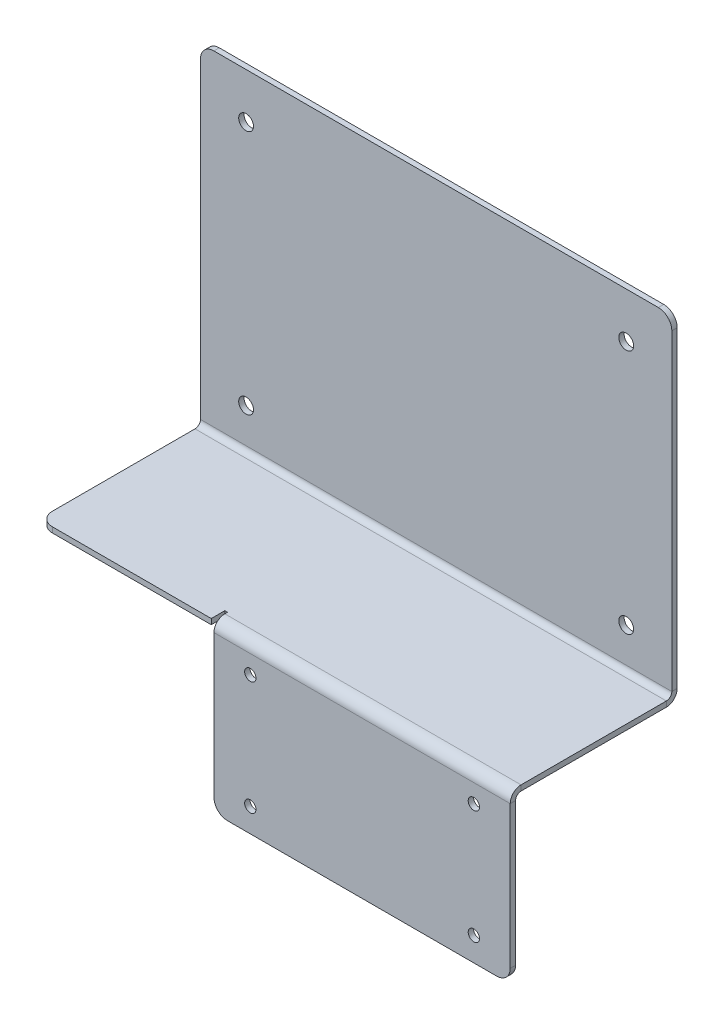
ISO-10303-21;
HEADER;
FILE_DESCRIPTION(('STEP AP214'),'2;1');
FILE_NAME('part.step','',(''),(''),'','','');
FILE_SCHEMA(('AUTOMOTIVE_DESIGN { 1 0 10303 214 1 1 1 1 }'));
ENDSEC;
DATA;
#1=APPLICATION_CONTEXT('core data for automotive mechanical design processes');
#2=APPLICATION_PROTOCOL_DEFINITION('international standard','automotive_design',2000,#1);
#3=PRODUCT_CONTEXT('',#1,'mechanical');
#4=PRODUCT('Part','Part','',(#3));
#5=PRODUCT_RELATED_PRODUCT_CATEGORY('part','',(#4));
#6=PRODUCT_DEFINITION_FORMATION('','',#4);
#7=PRODUCT_DEFINITION_CONTEXT('part definition',#1,'design');
#8=PRODUCT_DEFINITION('design','',#6,#7);
#9=PRODUCT_DEFINITION_SHAPE('','',#8);
#10=(LENGTH_UNIT() NAMED_UNIT(*) SI_UNIT(.MILLI.,.METRE.));
#11=(NAMED_UNIT(*) PLANE_ANGLE_UNIT() SI_UNIT($,.RADIAN.));
#12=(NAMED_UNIT(*) SI_UNIT($,.STERADIAN.) SOLID_ANGLE_UNIT());
#13=UNCERTAINTY_MEASURE_WITH_UNIT(LENGTH_MEASURE(1.E-05),#10,'distance_accuracy_value','');
#14=(GEOMETRIC_REPRESENTATION_CONTEXT(3) GLOBAL_UNCERTAINTY_ASSIGNED_CONTEXT((#13)) GLOBAL_UNIT_ASSIGNED_CONTEXT((#10,
#11,#12)) REPRESENTATION_CONTEXT('',''));
#15=CARTESIAN_POINT('',(0.,0.,0.));
#16=DIRECTION('',(0.,0.,1.));
#17=DIRECTION('',(1.,0.,0.));
#18=AXIS2_PLACEMENT_3D('',#15,#16,#17);
#19=CARTESIAN_POINT('',(0.,-62.500000000001,-2.23823397174791E-13));
#20=DIRECTION('',(0.,-1.,0.));
#21=DIRECTION('',(0.,0.,-1.));
#22=AXIS2_PLACEMENT_3D('',#19,#20,#21);
#23=PLANE('',#22);
#24=DIRECTION('',(1.,0.,0.));
#25=VECTOR('',#24,1.);
#26=CARTESIAN_POINT('',(87.5000000000004,-62.5000000000012,62.));
#27=LINE('',#26,#25);
#28=CARTESIAN_POINT('',(-82.4999999999997,-62.5000000000012,62.));
#29=VERTEX_POINT('',#28);
#30=CARTESIAN_POINT('',(-23.4999999999997,-62.5000000000012,62.));
#31=VERTEX_POINT('',#30);
#32=EDGE_CURVE('E311',#29,#31,#27,.T.);
#33=ORIENTED_EDGE('',*,*,#32,.F.);
#34=CARTESIAN_POINT('',(-82.4999999999997,-62.5000000000012,57.));
#35=DIRECTION('',(0.,-1.,0.));
#36=DIRECTION('',(0.,0.,-1.));
#37=AXIS2_PLACEMENT_3D('',#34,#35,#36);
#38=CIRCLE('',#37,5.);
#39=CARTESIAN_POINT('',(-87.4999999999997,-62.5000000000012,57.));
#40=VERTEX_POINT('',#39);
#41=EDGE_CURVE('E422',#29,#40,#38,.T.);
#42=ORIENTED_EDGE('',*,*,#41,.T.);
#43=DIRECTION('',(0.,0.,1.));
#44=VECTOR('',#43,1.);
#45=CARTESIAN_POINT('',(-87.4999999999997,-62.5000000000012,62.));
#46=LINE('',#45,#44);
#47=CARTESIAN_POINT('',(-87.4999999999997,-62.500000000001,4.02999999999999));
#48=VERTEX_POINT('',#47);
#49=EDGE_CURVE('E313',#48,#40,#46,.T.);
#50=ORIENTED_EDGE('',*,*,#49,.F.);
#51=DIRECTION('',(1.,0.,0.));
#52=VECTOR('',#51,1.);
#53=CARTESIAN_POINT('',(0.,-62.500000000001,4.02999999999999));
#54=LINE('',#53,#52);
#55=CARTESIAN_POINT('',(87.5000000000004,-62.500000000001,4.02999999999999));
#56=VERTEX_POINT('',#55);
#57=EDGE_CURVE('E323',#48,#56,#54,.T.);
#58=ORIENTED_EDGE('',*,*,#57,.T.);
#59=DIRECTION('',(0.,0.,-1.));
#60=VECTOR('',#59,1.);
#61=CARTESIAN_POINT('',(87.5000000000004,-62.500000000001,1.99999999999999));
#62=LINE('',#61,#60);
#63=CARTESIAN_POINT('',(87.5000000000004,-62.5000000000012,57.97));
#64=VERTEX_POINT('',#63);
#65=EDGE_CURVE('E308',#64,#56,#62,.T.);
#66=ORIENTED_EDGE('',*,*,#65,.F.);
#67=DIRECTION('',(-1.,0.,0.));
#68=VECTOR('',#67,1.);
#69=CARTESIAN_POINT('',(-22.4999999999997,-62.5000000000012,57.97));
#70=LINE('',#69,#68);
#71=CARTESIAN_POINT('',(-22.4999999999997,-62.5000000000012,57.97));
#72=VERTEX_POINT('',#71);
#73=EDGE_CURVE('E278',#72,#64,#70,.F.);
#74=ORIENTED_EDGE('',*,*,#73,.F.);
#75=DIRECTION('',(0.,0.,1.));
#76=VECTOR('',#75,1.);
#77=CARTESIAN_POINT('',(-22.4999999999997,-62.5000000000012,56.97));
#78=LINE('',#77,#76);
#79=CARTESIAN_POINT('',(-22.4999999999997,-62.5000000000012,56.97));
#80=VERTEX_POINT('',#79);
#81=EDGE_CURVE('E297',#80,#72,#78,.T.);
#82=ORIENTED_EDGE('',*,*,#81,.F.);
#83=DIRECTION('',(1.,0.,0.));
#84=VECTOR('',#83,1.);
#85=CARTESIAN_POINT('',(-23.4999999999997,-62.5000000000012,56.97));
#86=LINE('',#85,#84);
#87=CARTESIAN_POINT('',(-23.4999999999997,-62.5000000000012,56.97));
#88=VERTEX_POINT('',#87);
#89=EDGE_CURVE('E293',#88,#80,#86,.T.);
#90=ORIENTED_EDGE('',*,*,#89,.F.);
#91=DIRECTION('',(0.,0.,-1.));
#92=VECTOR('',#91,1.);
#93=CARTESIAN_POINT('',(-23.4999999999997,-62.5000000000012,62.));
#94=LINE('',#93,#92);
#95=EDGE_CURVE('E288',#31,#88,#94,.T.);
#96=ORIENTED_EDGE('',*,*,#95,.F.);
#97=EDGE_LOOP('',(#33,#42,#50,#58,#66,#74,#82,#90,#96));
#98=FACE_BOUND('',#97,.T.);
#99=ADVANCED_FACE('F76',(#98),#23,.T.);
#100=CARTESIAN_POINT('',(0.,-60.500000000001,-2.16840434497104E-13));
#101=DIRECTION('',(0.,-1.,0.));
#102=DIRECTION('',(0.,0.,-1.));
#103=AXIS2_PLACEMENT_3D('',#100,#101,#102);
#104=PLANE('',#103);
#105=DIRECTION('',(0.,0.,-1.));
#106=VECTOR('',#105,1.);
#107=CARTESIAN_POINT('',(-87.4999999999997,-60.500000000001,-2.16840434497104E-13));
#108=LINE('',#107,#106);
#109=CARTESIAN_POINT('',(-87.4999999999997,-60.500000000001,4.03));
#110=VERTEX_POINT('',#109);
#111=CARTESIAN_POINT('',(-87.4999999999997,-60.5000000000012,57.));
#112=VERTEX_POINT('',#111);
#113=EDGE_CURVE('E320',#110,#112,#108,.F.);
#114=ORIENTED_EDGE('',*,*,#113,.T.);
#115=CARTESIAN_POINT('',(-82.4999999999997,-60.5000000000012,57.));
#116=DIRECTION('',(0.,-1.,0.));
#117=DIRECTION('',(0.,0.,-1.));
#118=AXIS2_PLACEMENT_3D('',#115,#116,#117);
#119=CIRCLE('',#118,5.);
#120=CARTESIAN_POINT('',(-82.4999999999997,-60.5000000000012,62.));
#121=VERTEX_POINT('',#120);
#122=EDGE_CURVE('E418',#112,#121,#119,.F.);
#123=ORIENTED_EDGE('',*,*,#122,.T.);
#124=DIRECTION('',(-1.,0.,0.));
#125=VECTOR('',#124,1.);
#126=CARTESIAN_POINT('',(0.,-60.5000000000012,62.));
#127=LINE('',#126,#125);
#128=CARTESIAN_POINT('',(-23.4999999999997,-60.5000000000012,62.));
#129=VERTEX_POINT('',#128);
#130=EDGE_CURVE('E318',#121,#129,#127,.F.);
#131=ORIENTED_EDGE('',*,*,#130,.T.);
#132=DIRECTION('',(0.,0.,1.));
#133=VECTOR('',#132,1.);
#134=CARTESIAN_POINT('',(-23.4999999999997,-60.500000000001,-2.16840434497104E-13));
#135=LINE('',#134,#133);
#136=CARTESIAN_POINT('',(-23.4999999999997,-60.5000000000012,56.97));
#137=VERTEX_POINT('',#136);
#138=EDGE_CURVE('E291',#137,#129,#135,.T.);
#139=ORIENTED_EDGE('',*,*,#138,.F.);
#140=DIRECTION('',(-1.,0.,0.));
#141=VECTOR('',#140,1.);
#142=CARTESIAN_POINT('',(0.,-60.5000000000012,56.97));
#143=LINE('',#142,#141);
#144=CARTESIAN_POINT('',(-22.4999999999997,-60.5000000000012,56.97));
#145=VERTEX_POINT('',#144);
#146=EDGE_CURVE('E396',#145,#137,#143,.T.);
#147=ORIENTED_EDGE('',*,*,#146,.F.);
#148=DIRECTION('',(0.,0.,-1.));
#149=VECTOR('',#148,1.);
#150=CARTESIAN_POINT('',(-22.4999999999997,-60.500000000001,-2.16840434497104E-13));
#151=LINE('',#150,#149);
#152=CARTESIAN_POINT('',(-22.4999999999997,-60.5000000000012,57.97));
#153=VERTEX_POINT('',#152);
#154=EDGE_CURVE('E389',#153,#145,#151,.T.);
#155=ORIENTED_EDGE('',*,*,#154,.F.);
#156=DIRECTION('',(-1.,0.,0.));
#157=VECTOR('',#156,1.);
#158=CARTESIAN_POINT('',(-22.4999999999997,-60.5000000000012,57.97));
#159=LINE('',#158,#157);
#160=CARTESIAN_POINT('',(87.5000000000004,-60.5000000000012,57.97));
#161=VERTEX_POINT('',#160);
#162=EDGE_CURVE('E244',#153,#161,#159,.F.);
#163=ORIENTED_EDGE('',*,*,#162,.T.);
#164=DIRECTION('',(0.,0.,1.));
#165=VECTOR('',#164,1.);
#166=CARTESIAN_POINT('',(87.5000000000004,-60.500000000001,-2.16840434497104E-13));
#167=LINE('',#166,#165);
#168=CARTESIAN_POINT('',(87.5000000000004,-60.500000000001,4.03));
#169=VERTEX_POINT('',#168);
#170=EDGE_CURVE('E316',#161,#169,#167,.F.);
#171=ORIENTED_EDGE('',*,*,#170,.T.);
#172=DIRECTION('',(-1.,0.,0.));
#173=VECTOR('',#172,1.);
#174=CARTESIAN_POINT('',(-87.4999999999997,-60.500000000001,4.03));
#175=LINE('',#174,#173);
#176=EDGE_CURVE('E329',#110,#169,#175,.F.);
#177=ORIENTED_EDGE('',*,*,#176,.F.);
#178=EDGE_LOOP('',(#114,#123,#131,#139,#147,#155,#163,#171,#177));
#179=FACE_BOUND('',#178,.T.);
#180=ADVANCED_FACE('F460',(#179),#104,.F.);
#181=CARTESIAN_POINT('',(87.5000000000004,-62.5000000000012,62.));
#182=DIRECTION('',(0.,0.,1.));
#183=DIRECTION('',(0.,-1.,0.));
#184=AXIS2_PLACEMENT_3D('',#181,#182,#183);
#185=PLANE('',#184);
#186=ORIENTED_EDGE('',*,*,#130,.F.);
#187=DIRECTION('',(0.,1.,0.));
#188=VECTOR('',#187,1.);
#189=CARTESIAN_POINT('',(-82.4999999999997,-62.5000000000012,62.));
#190=LINE('',#189,#188);
#191=EDGE_CURVE('E420',#121,#29,#190,.F.);
#192=ORIENTED_EDGE('',*,*,#191,.T.);
#193=ORIENTED_EDGE('',*,*,#32,.T.);
#194=DIRECTION('',(0.,1.,0.));
#195=VECTOR('',#194,1.);
#196=CARTESIAN_POINT('',(-23.4999999999997,-62.5000000000012,62.));
#197=LINE('',#196,#195);
#198=EDGE_CURVE('E292',#31,#129,#197,.T.);
#199=ORIENTED_EDGE('',*,*,#198,.T.);
#200=EDGE_LOOP('',(#186,#192,#193,#199));
#201=FACE_BOUND('',#200,.T.);
#202=ADVANCED_FACE('F473',(#201),#185,.T.);
#203=CARTESIAN_POINT('',(0.,0.,2.));
#204=DIRECTION('',(0.,0.,-1.));
#205=DIRECTION('',(-1.,0.,0.));
#206=AXIS2_PLACEMENT_3D('',#203,#204,#205);
#207=PLANE('',#206);
#208=CARTESIAN_POINT('',(-70.5633999999997,-45.5633999999989,2.));
#209=DIRECTION('',(0.,0.,1.));
#210=DIRECTION('',(1.,0.,0.));
#211=AXIS2_PLACEMENT_3D('',#208,#209,#210);
#212=CIRCLE('',#211,2.75000000000002);
#213=CARTESIAN_POINT('',(-67.8133999999997,-45.5633999999989,2.));
#214=VERTEX_POINT('',#213);
#215=EDGE_CURVE('E358',#214,#214,#212,.T.);
#216=ORIENTED_EDGE('',*,*,#215,.F.);
#217=EDGE_LOOP('',(#216));
#218=FACE_BOUND('',#217,.T.);
#219=CARTESIAN_POINT('',(-70.5633999999988,45.5634000000009,2.));
#220=DIRECTION('',(0.,0.,1.));
#221=DIRECTION('',(1.,0.,0.));
#222=AXIS2_PLACEMENT_3D('',#219,#220,#221);
#223=CIRCLE('',#222,2.75000000000002);
#224=CARTESIAN_POINT('',(-67.8133999999988,45.5634000000009,2.));
#225=VERTEX_POINT('',#224);
#226=EDGE_CURVE('E364',#225,#225,#223,.T.);
#227=ORIENTED_EDGE('',*,*,#226,.F.);
#228=EDGE_LOOP('',(#227));
#229=FACE_BOUND('',#228,.T.);
#230=CARTESIAN_POINT('',(70.5634000000006,-45.5634000000003,2.));
#231=DIRECTION('',(0.,0.,1.));
#232=DIRECTION('',(1.,0.,0.));
#233=AXIS2_PLACEMENT_3D('',#230,#231,#232);
#234=CIRCLE('',#233,2.75000000000002);
#235=CARTESIAN_POINT('',(73.3134000000006,-45.5634000000003,2.));
#236=VERTEX_POINT('',#235);
#237=EDGE_CURVE('E370',#236,#236,#234,.T.);
#238=ORIENTED_EDGE('',*,*,#237,.F.);
#239=EDGE_LOOP('',(#238));
#240=FACE_BOUND('',#239,.T.);
#241=CARTESIAN_POINT('',(70.5634000000013,45.5633999999998,2.));
#242=DIRECTION('',(0.,0.,1.));
#243=DIRECTION('',(1.,0.,0.));
#244=AXIS2_PLACEMENT_3D('',#241,#242,#243);
#245=CIRCLE('',#244,2.75000000000002);
#246=CARTESIAN_POINT('',(73.3134000000013,45.5633999999998,2.));
#247=VERTEX_POINT('',#246);
#248=EDGE_CURVE('E376',#247,#247,#245,.T.);
#249=ORIENTED_EDGE('',*,*,#248,.F.);
#250=EDGE_LOOP('',(#249));
#251=FACE_BOUND('',#250,.T.);
#252=DIRECTION('',(0.,1.,0.));
#253=VECTOR('',#252,1.);
#254=CARTESIAN_POINT('',(87.5000000000004,62.5,2.));
#255=LINE('',#254,#253);
#256=CARTESIAN_POINT('',(87.5000000000004,-58.470000000001,2.00000000000001));
#257=VERTEX_POINT('',#256);
#258=CARTESIAN_POINT('',(87.5000000000004,57.5,2.));
#259=VERTEX_POINT('',#258);
#260=EDGE_CURVE('E387',#257,#259,#255,.T.);
#261=ORIENTED_EDGE('',*,*,#260,.T.);
#262=CARTESIAN_POINT('',(82.5000000000004,57.5,2.));
#263=DIRECTION('',(0.,0.,-1.));
#264=DIRECTION('',(-1.,0.,0.));
#265=AXIS2_PLACEMENT_3D('',#262,#263,#264);
#266=CIRCLE('',#265,5.);
#267=CARTESIAN_POINT('',(82.5000000000004,62.5,2.));
#268=VERTEX_POINT('',#267);
#269=EDGE_CURVE('E84',#259,#268,#266,.F.);
#270=ORIENTED_EDGE('',*,*,#269,.T.);
#271=DIRECTION('',(-1.,0.,0.));
#272=VECTOR('',#271,1.);
#273=CARTESIAN_POINT('',(-87.4999999999997,62.5,2.));
#274=LINE('',#273,#272);
#275=CARTESIAN_POINT('',(-82.4999999999997,62.5,2.));
#276=VERTEX_POINT('',#275);
#277=EDGE_CURVE('E382',#268,#276,#274,.T.);
#278=ORIENTED_EDGE('',*,*,#277,.T.);
#279=CARTESIAN_POINT('',(-82.4999999999997,57.5,2.));
#280=DIRECTION('',(0.,0.,-1.));
#281=DIRECTION('',(-1.,0.,0.));
#282=AXIS2_PLACEMENT_3D('',#279,#280,#281);
#283=CIRCLE('',#282,5.);
#284=CARTESIAN_POINT('',(-87.4999999999997,57.5,2.));
#285=VERTEX_POINT('',#284);
#286=EDGE_CURVE('E91',#276,#285,#283,.F.);
#287=ORIENTED_EDGE('',*,*,#286,.T.);
#288=DIRECTION('',(0.,-1.,0.));
#289=VECTOR('',#288,1.);
#290=CARTESIAN_POINT('',(-87.4999999999997,62.5,2.));
#291=LINE('',#290,#289);
#292=CARTESIAN_POINT('',(-87.4999999999997,-58.470000000001,2.00000000000001));
#293=VERTEX_POINT('',#292);
#294=EDGE_CURVE('E384',#285,#293,#291,.T.);
#295=ORIENTED_EDGE('',*,*,#294,.T.);
#296=DIRECTION('',(1.,0.,0.));
#297=VECTOR('',#296,1.);
#298=CARTESIAN_POINT('',(87.5000000000004,-58.470000000001,2.00000000000001));
#299=LINE('',#298,#297);
#300=EDGE_CURVE('E347',#257,#293,#299,.F.);
#301=ORIENTED_EDGE('',*,*,#300,.F.);
#302=EDGE_LOOP('',(#261,#270,#278,#287,#295,#301));
#303=FACE_BOUND('',#302,.T.);
#304=ADVANCED_FACE('F436',(#218,#229,#240,#251,#303),#207,.F.);
#305=CARTESIAN_POINT('',(0.,0.,0.));
#306=DIRECTION('',(0.,0.,-1.));
#307=DIRECTION('',(-1.,0.,0.));
#308=AXIS2_PLACEMENT_3D('',#305,#306,#307);
#309=PLANE('',#308);
#310=CARTESIAN_POINT('',(-70.5633999999988,45.5634000000009,0.));
#311=DIRECTION('',(0.,0.,1.));
#312=DIRECTION('',(1.,0.,0.));
#313=AXIS2_PLACEMENT_3D('',#310,#311,#312);
#314=CIRCLE('',#313,2.75000000000002);
#315=CARTESIAN_POINT('',(-67.8133999999988,45.5634000000009,0.));
#316=VERTEX_POINT('',#315);
#317=EDGE_CURVE('E361',#316,#316,#314,.T.);
#318=ORIENTED_EDGE('',*,*,#317,.T.);
#319=EDGE_LOOP('',(#318));
#320=FACE_BOUND('',#319,.T.);
#321=CARTESIAN_POINT('',(70.5634000000013,45.5633999999998,0.));
#322=DIRECTION('',(0.,0.,1.));
#323=DIRECTION('',(1.,0.,0.));
#324=AXIS2_PLACEMENT_3D('',#321,#322,#323);
#325=CIRCLE('',#324,2.75000000000002);
#326=CARTESIAN_POINT('',(73.3134000000013,45.5633999999998,0.));
#327=VERTEX_POINT('',#326);
#328=EDGE_CURVE('E373',#327,#327,#325,.T.);
#329=ORIENTED_EDGE('',*,*,#328,.T.);
#330=EDGE_LOOP('',(#329));
#331=FACE_BOUND('',#330,.T.);
#332=CARTESIAN_POINT('',(70.5634000000006,-45.5634000000003,0.));
#333=DIRECTION('',(0.,0.,1.));
#334=DIRECTION('',(1.,0.,0.));
#335=AXIS2_PLACEMENT_3D('',#332,#333,#334);
#336=CIRCLE('',#335,2.75000000000002);
#337=CARTESIAN_POINT('',(73.3134000000006,-45.5634000000003,0.));
#338=VERTEX_POINT('',#337);
#339=EDGE_CURVE('E367',#338,#338,#336,.T.);
#340=ORIENTED_EDGE('',*,*,#339,.T.);
#341=EDGE_LOOP('',(#340));
#342=FACE_BOUND('',#341,.T.);
#343=CARTESIAN_POINT('',(-70.5633999999997,-45.5633999999989,0.));
#344=DIRECTION('',(0.,0.,1.));
#345=DIRECTION('',(1.,0.,0.));
#346=AXIS2_PLACEMENT_3D('',#343,#344,#345);
#347=CIRCLE('',#346,2.75000000000002);
#348=CARTESIAN_POINT('',(-67.8133999999997,-45.5633999999989,0.));
#349=VERTEX_POINT('',#348);
#350=EDGE_CURVE('E355',#349,#349,#347,.T.);
#351=ORIENTED_EDGE('',*,*,#350,.T.);
#352=EDGE_LOOP('',(#351));
#353=FACE_BOUND('',#352,.T.);
#354=DIRECTION('',(-1.,0.,0.));
#355=VECTOR('',#354,1.);
#356=CARTESIAN_POINT('',(-87.4999999999997,62.5,0.));
#357=LINE('',#356,#355);
#358=CARTESIAN_POINT('',(82.5000000000004,62.5,0.));
#359=VERTEX_POINT('',#358);
#360=CARTESIAN_POINT('',(-82.4999999999997,62.5,0.));
#361=VERTEX_POINT('',#360);
#362=EDGE_CURVE('E379',#359,#361,#357,.T.);
#363=ORIENTED_EDGE('',*,*,#362,.F.);
#364=CARTESIAN_POINT('',(82.5000000000004,57.5,0.));
#365=DIRECTION('',(0.,0.,-1.));
#366=DIRECTION('',(-1.,0.,0.));
#367=AXIS2_PLACEMENT_3D('',#364,#365,#366);
#368=CIRCLE('',#367,5.);
#369=CARTESIAN_POINT('',(87.5000000000004,57.5,0.));
#370=VERTEX_POINT('',#369);
#371=EDGE_CURVE('E431',#359,#370,#368,.T.);
#372=ORIENTED_EDGE('',*,*,#371,.T.);
#373=DIRECTION('',(0.,1.,0.));
#374=VECTOR('',#373,1.);
#375=CARTESIAN_POINT('',(87.5000000000004,62.5,0.));
#376=LINE('',#375,#374);
#377=CARTESIAN_POINT('',(87.5000000000004,-58.470000000001,0.));
#378=VERTEX_POINT('',#377);
#379=EDGE_CURVE('E385',#378,#370,#376,.T.);
#380=ORIENTED_EDGE('',*,*,#379,.F.);
#381=DIRECTION('',(1.,0.,0.));
#382=VECTOR('',#381,1.);
#383=CARTESIAN_POINT('',(87.5000000000004,-58.470000000001,0.));
#384=LINE('',#383,#382);
#385=CARTESIAN_POINT('',(-87.4999999999997,-58.470000000001,0.));
#386=VERTEX_POINT('',#385);
#387=EDGE_CURVE('E334',#378,#386,#384,.F.);
#388=ORIENTED_EDGE('',*,*,#387,.T.);
#389=DIRECTION('',(0.,-1.,0.));
#390=VECTOR('',#389,1.);
#391=CARTESIAN_POINT('',(-87.4999999999997,62.5,0.));
#392=LINE('',#391,#390);
#393=CARTESIAN_POINT('',(-87.4999999999997,57.5,0.));
#394=VERTEX_POINT('',#393);
#395=EDGE_CURVE('E392',#394,#386,#392,.T.);
#396=ORIENTED_EDGE('',*,*,#395,.F.);
#397=CARTESIAN_POINT('',(-82.4999999999997,57.5,0.));
#398=DIRECTION('',(0.,0.,-1.));
#399=DIRECTION('',(-1.,0.,0.));
#400=AXIS2_PLACEMENT_3D('',#397,#398,#399);
#401=CIRCLE('',#400,5.);
#402=EDGE_CURVE('E429',#394,#361,#401,.T.);
#403=ORIENTED_EDGE('',*,*,#402,.T.);
#404=EDGE_LOOP('',(#363,#372,#380,#388,#396,#403));
#405=FACE_BOUND('',#404,.T.);
#406=ADVANCED_FACE('F447',(#320,#331,#342,#353,#405),#309,.T.);
#407=CARTESIAN_POINT('',(-87.4999999999997,62.5,2.));
#408=DIRECTION('',(1.,0.,0.));
#409=DIRECTION('',(0.,0.,-1.));
#410=AXIS2_PLACEMENT_3D('',#407,#408,#409);
#411=PLANE('',#410);
#412=ORIENTED_EDGE('',*,*,#294,.F.);
#413=DIRECTION('',(0.,0.,-1.));
#414=VECTOR('',#413,1.);
#415=CARTESIAN_POINT('',(-87.4999999999997,57.5,2.));
#416=LINE('',#415,#414);
#417=EDGE_CURVE('E13',#285,#394,#416,.T.);
#418=ORIENTED_EDGE('',*,*,#417,.T.);
#419=ORIENTED_EDGE('',*,*,#395,.T.);
#420=DIRECTION('',(0.,0.,-1.));
#421=VECTOR('',#420,1.);
#422=CARTESIAN_POINT('',(-87.4999999999997,-58.470000000001,2.00000000000001));
#423=LINE('',#422,#421);
#424=EDGE_CURVE('E352',#293,#386,#423,.T.);
#425=ORIENTED_EDGE('',*,*,#424,.F.);
#426=EDGE_LOOP('',(#412,#418,#419,#425));
#427=FACE_BOUND('',#426,.T.);
#428=ADVANCED_FACE('F612',(#427),#411,.F.);
#429=CARTESIAN_POINT('',(87.5000000000004,62.5,2.));
#430=DIRECTION('',(-1.,0.,0.));
#431=DIRECTION('',(0.,0.,1.));
#432=AXIS2_PLACEMENT_3D('',#429,#430,#431);
#433=PLANE('',#432);
#434=ORIENTED_EDGE('',*,*,#379,.T.);
#435=DIRECTION('',(0.,0.,-1.));
#436=VECTOR('',#435,1.);
#437=CARTESIAN_POINT('',(87.5000000000004,57.5,2.));
#438=LINE('',#437,#436);
#439=EDGE_CURVE('E99',#370,#259,#438,.F.);
#440=ORIENTED_EDGE('',*,*,#439,.T.);
#441=ORIENTED_EDGE('',*,*,#260,.F.);
#442=DIRECTION('',(0.,0.,-1.));
#443=VECTOR('',#442,1.);
#444=CARTESIAN_POINT('',(87.5000000000004,-58.470000000001,2.00000000000001));
#445=LINE('',#444,#443);
#446=EDGE_CURVE('E341',#257,#378,#445,.T.);
#447=ORIENTED_EDGE('',*,*,#446,.T.);
#448=EDGE_LOOP('',(#434,#440,#441,#447));
#449=FACE_BOUND('',#448,.T.);
#450=ADVANCED_FACE('F448',(#449),#433,.F.);
#451=CARTESIAN_POINT('',(-87.4999999999997,62.5,2.));
#452=DIRECTION('',(0.,-1.,0.));
#453=DIRECTION('',(0.,0.,-1.));
#454=AXIS2_PLACEMENT_3D('',#451,#452,#453);
#455=PLANE('',#454);
#456=ORIENTED_EDGE('',*,*,#277,.F.);
#457=DIRECTION('',(0.,0.,-1.));
#458=VECTOR('',#457,1.);
#459=CARTESIAN_POINT('',(82.5000000000004,62.5,2.));
#460=LINE('',#459,#458);
#461=EDGE_CURVE('E426',#268,#359,#460,.T.);
#462=ORIENTED_EDGE('',*,*,#461,.T.);
#463=ORIENTED_EDGE('',*,*,#362,.T.);
#464=DIRECTION('',(0.,0.,-1.));
#465=VECTOR('',#464,1.);
#466=CARTESIAN_POINT('',(-82.4999999999997,62.5,2.));
#467=LINE('',#466,#465);
#468=EDGE_CURVE('E424',#361,#276,#467,.F.);
#469=ORIENTED_EDGE('',*,*,#468,.T.);
#470=EDGE_LOOP('',(#456,#462,#463,#469));
#471=FACE_BOUND('',#470,.T.);
#472=ADVANCED_FACE('F441',(#471),#455,.F.);
#473=CARTESIAN_POINT('',(70.5634000000013,45.5633999999998,2.));
#474=DIRECTION('',(0.,0.,-1.));
#475=DIRECTION('',(-1.,0.,0.));
#476=AXIS2_PLACEMENT_3D('',#473,#474,#475);
#477=CYLINDRICAL_SURFACE('',#476,2.75000000000002);
#478=ORIENTED_EDGE('',*,*,#248,.T.);
#479=EDGE_LOOP('',(#478));
#480=FACE_BOUND('',#479,.T.);
#481=ORIENTED_EDGE('',*,*,#328,.F.);
#482=EDGE_LOOP('',(#481));
#483=FACE_BOUND('',#482,.T.);
#484=ADVANCED_FACE('F602',(#480,#483),#477,.F.);
#485=CARTESIAN_POINT('',(70.5634000000006,-45.5634000000003,2.));
#486=DIRECTION('',(0.,0.,-1.));
#487=DIRECTION('',(-1.,0.,0.));
#488=AXIS2_PLACEMENT_3D('',#485,#486,#487);
#489=CYLINDRICAL_SURFACE('',#488,2.75000000000002);
#490=ORIENTED_EDGE('',*,*,#237,.T.);
#491=EDGE_LOOP('',(#490));
#492=FACE_BOUND('',#491,.T.);
#493=ORIENTED_EDGE('',*,*,#339,.F.);
#494=EDGE_LOOP('',(#493));
#495=FACE_BOUND('',#494,.T.);
#496=ADVANCED_FACE('F598',(#492,#495),#489,.F.);
#497=CARTESIAN_POINT('',(-70.5633999999988,45.5634000000009,2.));
#498=DIRECTION('',(0.,0.,-1.));
#499=DIRECTION('',(-1.,0.,0.));
#500=AXIS2_PLACEMENT_3D('',#497,#498,#499);
#501=CYLINDRICAL_SURFACE('',#500,2.75000000000002);
#502=ORIENTED_EDGE('',*,*,#226,.T.);
#503=EDGE_LOOP('',(#502));
#504=FACE_BOUND('',#503,.T.);
#505=ORIENTED_EDGE('',*,*,#317,.F.);
#506=EDGE_LOOP('',(#505));
#507=FACE_BOUND('',#506,.T.);
#508=ADVANCED_FACE('F594',(#504,#507),#501,.F.);
#509=CARTESIAN_POINT('',(-70.5633999999997,-45.5633999999989,2.));
#510=DIRECTION('',(0.,0.,-1.));
#511=DIRECTION('',(-1.,0.,0.));
#512=AXIS2_PLACEMENT_3D('',#509,#510,#511);
#513=CYLINDRICAL_SURFACE('',#512,2.75000000000002);
#514=ORIENTED_EDGE('',*,*,#215,.T.);
#515=EDGE_LOOP('',(#514));
#516=FACE_BOUND('',#515,.T.);
#517=ORIENTED_EDGE('',*,*,#350,.F.);
#518=EDGE_LOOP('',(#517));
#519=FACE_BOUND('',#518,.T.);
#520=ADVANCED_FACE('F588',(#516,#519),#513,.F.);
#521=CARTESIAN_POINT('',(-87.4999999999997,-58.470000000001,4.03000000000001));
#522=DIRECTION('',(-1.,0.,0.));
#523=DIRECTION('',(0.,0.,1.));
#524=AXIS2_PLACEMENT_3D('',#521,#522,#523);
#525=PLANE('',#524);
#526=DIRECTION('',(0.,-1.,0.));
#527=VECTOR('',#526,1.);
#528=CARTESIAN_POINT('',(-87.4999999999997,-62.500000000001,4.02999999999999));
#529=LINE('',#528,#527);
#530=EDGE_CURVE('E307',#110,#48,#529,.T.);
#531=ORIENTED_EDGE('',*,*,#530,.F.);
#532=CARTESIAN_POINT('',(-87.4999999999997,-58.470000000001,4.03000000000001));
#533=DIRECTION('',(1.,0.,0.));
#534=DIRECTION('',(0.,0.,-1.));
#535=AXIS2_PLACEMENT_3D('',#532,#533,#534);
#536=CIRCLE('',#535,2.03);
#537=EDGE_CURVE('E344',#293,#110,#536,.F.);
#538=ORIENTED_EDGE('',*,*,#537,.F.);
#539=ORIENTED_EDGE('',*,*,#424,.T.);
#540=CARTESIAN_POINT('',(-87.4999999999997,-58.470000000001,4.03000000000001));
#541=DIRECTION('',(1.,0.,0.));
#542=DIRECTION('',(0.,0.,-1.));
#543=AXIS2_PLACEMENT_3D('',#540,#541,#542);
#544=CIRCLE('',#543,4.03);
#545=EDGE_CURVE('E337',#386,#48,#544,.F.);
#546=ORIENTED_EDGE('',*,*,#545,.T.);
#547=EDGE_LOOP('',(#531,#538,#539,#546));
#548=FACE_BOUND('',#547,.T.);
#549=ADVANCED_FACE('F585',(#548),#525,.T.);
#550=CARTESIAN_POINT('',(87.5000000000004,-58.470000000001,4.03000000000001));
#551=DIRECTION('',(-1.,0.,0.));
#552=DIRECTION('',(0.,0.,1.));
#553=AXIS2_PLACEMENT_3D('',#550,#551,#552);
#554=PLANE('',#553);
#555=CARTESIAN_POINT('',(87.5000000000004,-58.470000000001,4.03000000000001));
#556=DIRECTION('',(1.,0.,0.));
#557=DIRECTION('',(0.,0.,-1.));
#558=AXIS2_PLACEMENT_3D('',#555,#556,#557);
#559=CIRCLE('',#558,2.03);
#560=EDGE_CURVE('E310',#169,#257,#559,.T.);
#561=ORIENTED_EDGE('',*,*,#560,.F.);
#562=DIRECTION('',(0.,-1.,0.));
#563=VECTOR('',#562,1.);
#564=CARTESIAN_POINT('',(87.5000000000004,-60.500000000001,4.03));
#565=LINE('',#564,#563);
#566=EDGE_CURVE('E326',#169,#56,#565,.T.);
#567=ORIENTED_EDGE('',*,*,#566,.T.);
#568=CARTESIAN_POINT('',(87.5000000000004,-58.470000000001,4.03000000000001));
#569=DIRECTION('',(1.,0.,0.));
#570=DIRECTION('',(0.,0.,-1.));
#571=AXIS2_PLACEMENT_3D('',#568,#569,#570);
#572=CIRCLE('',#571,4.03);
#573=EDGE_CURVE('E338',#56,#378,#572,.T.);
#574=ORIENTED_EDGE('',*,*,#573,.T.);
#575=ORIENTED_EDGE('',*,*,#446,.F.);
#576=EDGE_LOOP('',(#561,#567,#574,#575));
#577=FACE_BOUND('',#576,.T.);
#578=ADVANCED_FACE('F451',(#577),#554,.F.);
#579=CARTESIAN_POINT('',(87.5000000000004,-58.470000000001,4.03000000000001));
#580=DIRECTION('',(1.,0.,0.));
#581=DIRECTION('',(0.,-1.,0.));
#582=AXIS2_PLACEMENT_3D('',#579,#580,#581);
#583=CYLINDRICAL_SURFACE('',#582,4.03);
#584=ORIENTED_EDGE('',*,*,#387,.F.);
#585=ORIENTED_EDGE('',*,*,#573,.F.);
#586=ORIENTED_EDGE('',*,*,#57,.F.);
#587=ORIENTED_EDGE('',*,*,#545,.F.);
#588=EDGE_LOOP('',(#584,#585,#586,#587));
#589=FACE_BOUND('',#588,.T.);
#590=ADVANCED_FACE('F579',(#589),#583,.T.);
#591=CARTESIAN_POINT('',(87.5000000000004,-58.470000000001,4.03000000000001));
#592=DIRECTION('',(1.,0.,0.));
#593=DIRECTION('',(0.,-1.,0.));
#594=AXIS2_PLACEMENT_3D('',#591,#592,#593);
#595=CYLINDRICAL_SURFACE('',#594,2.03);
#596=ORIENTED_EDGE('',*,*,#300,.T.);
#597=ORIENTED_EDGE('',*,*,#537,.T.);
#598=ORIENTED_EDGE('',*,*,#176,.T.);
#599=ORIENTED_EDGE('',*,*,#560,.T.);
#600=EDGE_LOOP('',(#596,#597,#598,#599));
#601=FACE_BOUND('',#600,.T.);
#602=ADVANCED_FACE('F455',(#601),#595,.F.);
#603=CARTESIAN_POINT('',(87.5000000000004,-62.500000000001,1.99999999999999));
#604=DIRECTION('',(1.,0.,0.));
#605=DIRECTION('',(0.,0.,-1.));
#606=AXIS2_PLACEMENT_3D('',#603,#604,#605);
#607=PLANE('',#606);
#608=DIRECTION('',(0.,1.,0.));
#609=VECTOR('',#608,1.);
#610=CARTESIAN_POINT('',(87.5000000000004,-62.5000000000012,57.97));
#611=LINE('',#610,#609);
#612=EDGE_CURVE('E282',#64,#161,#611,.T.);
#613=ORIENTED_EDGE('',*,*,#612,.F.);
#614=ORIENTED_EDGE('',*,*,#65,.T.);
#615=ORIENTED_EDGE('',*,*,#566,.F.);
#616=ORIENTED_EDGE('',*,*,#170,.F.);
#617=EDGE_LOOP('',(#613,#614,#615,#616));
#618=FACE_BOUND('',#617,.T.);
#619=ADVANCED_FACE('F571',(#618),#607,.T.);
#620=CARTESIAN_POINT('',(-87.4999999999997,-62.5000000000012,62.));
#621=DIRECTION('',(-1.,0.,0.));
#622=DIRECTION('',(0.,0.,1.));
#623=AXIS2_PLACEMENT_3D('',#620,#621,#622);
#624=PLANE('',#623);
#625=ORIENTED_EDGE('',*,*,#49,.T.);
#626=DIRECTION('',(0.,1.,0.));
#627=VECTOR('',#626,1.);
#628=CARTESIAN_POINT('',(-87.4999999999997,-62.5000000000012,57.));
#629=LINE('',#628,#627);
#630=EDGE_CURVE('E415',#40,#112,#629,.T.);
#631=ORIENTED_EDGE('',*,*,#630,.T.);
#632=ORIENTED_EDGE('',*,*,#113,.F.);
#633=ORIENTED_EDGE('',*,*,#530,.T.);
#634=EDGE_LOOP('',(#625,#631,#632,#633));
#635=FACE_BOUND('',#634,.T.);
#636=ADVANCED_FACE('F463',(#635),#624,.T.);
#637=CARTESIAN_POINT('',(-23.4999999999997,-62.5000000000012,56.97));
#638=DIRECTION('',(0.,0.,1.));
#639=DIRECTION('',(0.,-1.,0.));
#640=AXIS2_PLACEMENT_3D('',#637,#638,#639);
#641=PLANE('',#640);
#642=DIRECTION('',(0.,1.,0.));
#643=VECTOR('',#642,1.);
#644=CARTESIAN_POINT('',(-22.4999999999997,-62.5000000000012,56.97));
#645=LINE('',#644,#643);
#646=EDGE_CURVE('E285',#80,#145,#645,.T.);
#647=ORIENTED_EDGE('',*,*,#646,.T.);
#648=ORIENTED_EDGE('',*,*,#146,.T.);
#649=DIRECTION('',(0.,1.,0.));
#650=VECTOR('',#649,1.);
#651=CARTESIAN_POINT('',(-23.4999999999997,-62.5000000000012,56.97));
#652=LINE('',#651,#650);
#653=EDGE_CURVE('E296',#88,#137,#652,.T.);
#654=ORIENTED_EDGE('',*,*,#653,.F.);
#655=ORIENTED_EDGE('',*,*,#89,.T.);
#656=EDGE_LOOP('',(#647,#648,#654,#655));
#657=FACE_BOUND('',#656,.T.);
#658=ADVANCED_FACE('F484',(#657),#641,.T.);
#659=CARTESIAN_POINT('',(-22.4999999999997,-62.5000000000012,56.97));
#660=DIRECTION('',(-1.,0.,0.));
#661=DIRECTION('',(0.,0.,1.));
#662=AXIS2_PLACEMENT_3D('',#659,#660,#661);
#663=PLANE('',#662);
#664=DIRECTION('',(0.,1.,0.));
#665=VECTOR('',#664,1.);
#666=CARTESIAN_POINT('',(-22.4999999999997,-62.5000000000012,57.97));
#667=LINE('',#666,#665);
#668=EDGE_CURVE('E274',#72,#153,#667,.T.);
#669=ORIENTED_EDGE('',*,*,#668,.T.);
#670=ORIENTED_EDGE('',*,*,#154,.T.);
#671=ORIENTED_EDGE('',*,*,#646,.F.);
#672=ORIENTED_EDGE('',*,*,#81,.T.);
#673=EDGE_LOOP('',(#669,#670,#671,#672));
#674=FACE_BOUND('',#673,.T.);
#675=ADVANCED_FACE('F487',(#674),#663,.T.);
#676=CARTESIAN_POINT('',(-23.4999999999997,-62.5000000000012,62.));
#677=DIRECTION('',(1.,0.,0.));
#678=DIRECTION('',(0.,0.,-1.));
#679=AXIS2_PLACEMENT_3D('',#676,#677,#678);
#680=PLANE('',#679);
#681=ORIENTED_EDGE('',*,*,#653,.T.);
#682=ORIENTED_EDGE('',*,*,#138,.T.);
#683=ORIENTED_EDGE('',*,*,#198,.F.);
#684=ORIENTED_EDGE('',*,*,#95,.T.);
#685=EDGE_LOOP('',(#681,#682,#683,#684));
#686=FACE_BOUND('',#685,.T.);
#687=ADVANCED_FACE('F478',(#686),#680,.T.);
#688=CARTESIAN_POINT('',(87.5000000000004,-64.5300000000012,57.97));
#689=DIRECTION('',(1.,0.,0.));
#690=DIRECTION('',(0.,0.,-1.));
#691=AXIS2_PLACEMENT_3D('',#688,#689,#690);
#692=PLANE('',#691);
#693=DIRECTION('',(0.,0.,1.));
#694=VECTOR('',#693,1.);
#695=CARTESIAN_POINT('',(87.5000000000004,-64.5300000000012,62.));
#696=LINE('',#695,#694);
#697=CARTESIAN_POINT('',(87.5000000000004,-64.5300000000012,60.));
#698=VERTEX_POINT('',#697);
#699=CARTESIAN_POINT('',(87.5000000000004,-64.5300000000012,62.));
#700=VERTEX_POINT('',#699);
#701=EDGE_CURVE('E268',#698,#700,#696,.T.);
#702=ORIENTED_EDGE('',*,*,#701,.F.);
#703=CARTESIAN_POINT('',(87.5000000000004,-64.5300000000012,57.97));
#704=DIRECTION('',(-1.,0.,0.));
#705=DIRECTION('',(0.,0.,1.));
#706=AXIS2_PLACEMENT_3D('',#703,#704,#705);
#707=CIRCLE('',#706,2.03);
#708=EDGE_CURVE('E247',#64,#698,#707,.F.);
#709=ORIENTED_EDGE('',*,*,#708,.F.);
#710=ORIENTED_EDGE('',*,*,#612,.T.);
#711=CARTESIAN_POINT('',(87.5000000000004,-64.5300000000012,57.97));
#712=DIRECTION('',(-1.,0.,0.));
#713=DIRECTION('',(0.,0.,1.));
#714=AXIS2_PLACEMENT_3D('',#711,#712,#713);
#715=CIRCLE('',#714,4.03);
#716=EDGE_CURVE('E273',#161,#700,#715,.F.);
#717=ORIENTED_EDGE('',*,*,#716,.T.);
#718=EDGE_LOOP('',(#702,#709,#710,#717));
#719=FACE_BOUND('',#718,.T.);
#720=ADVANCED_FACE('F642',(#719),#692,.T.);
#721=CARTESIAN_POINT('',(-22.4999999999997,-64.5300000000012,57.97));
#722=DIRECTION('',(1.,0.,0.));
#723=DIRECTION('',(0.,0.,-1.));
#724=AXIS2_PLACEMENT_3D('',#721,#722,#723);
#725=PLANE('',#724);
#726=CARTESIAN_POINT('',(-22.4999999999997,-64.5300000000012,57.97));
#727=DIRECTION('',(-1.,0.,0.));
#728=DIRECTION('',(0.,0.,1.));
#729=AXIS2_PLACEMENT_3D('',#726,#727,#728);
#730=CIRCLE('',#729,2.03);
#731=CARTESIAN_POINT('',(-22.4999999999997,-64.5300000000012,60.));
#732=VERTEX_POINT('',#731);
#733=EDGE_CURVE('E233',#732,#72,#730,.T.);
#734=ORIENTED_EDGE('',*,*,#733,.F.);
#735=DIRECTION('',(0.,0.,1.));
#736=VECTOR('',#735,1.);
#737=CARTESIAN_POINT('',(-22.4999999999997,-64.5300000000012,60.));
#738=LINE('',#737,#736);
#739=CARTESIAN_POINT('',(-22.4999999999997,-64.5300000000012,62.));
#740=VERTEX_POINT('',#739);
#741=EDGE_CURVE('E227',#732,#740,#738,.T.);
#742=ORIENTED_EDGE('',*,*,#741,.T.);
#743=CARTESIAN_POINT('',(-22.4999999999997,-64.5300000000012,57.97));
#744=DIRECTION('',(-1.,0.,0.));
#745=DIRECTION('',(0.,0.,1.));
#746=AXIS2_PLACEMENT_3D('',#743,#744,#745);
#747=CIRCLE('',#746,4.03);
#748=EDGE_CURVE('E239',#740,#153,#747,.T.);
#749=ORIENTED_EDGE('',*,*,#748,.T.);
#750=ORIENTED_EDGE('',*,*,#668,.F.);
#751=EDGE_LOOP('',(#734,#742,#749,#750));
#752=FACE_BOUND('',#751,.T.);
#753=ADVANCED_FACE('F250',(#752),#725,.F.);
#754=CARTESIAN_POINT('',(-22.4999999999997,-64.5300000000012,57.97));
#755=DIRECTION('',(-1.,0.,0.));
#756=DIRECTION('',(0.,0.,1.));
#757=AXIS2_PLACEMENT_3D('',#754,#755,#756);
#758=CYLINDRICAL_SURFACE('',#757,4.03);
#759=ORIENTED_EDGE('',*,*,#162,.F.);
#760=ORIENTED_EDGE('',*,*,#748,.F.);
#761=DIRECTION('',(-1.,0.,0.));
#762=VECTOR('',#761,1.);
#763=CARTESIAN_POINT('',(0.,-64.5300000000012,62.));
#764=LINE('',#763,#762);
#765=EDGE_CURVE('E242',#700,#740,#764,.T.);
#766=ORIENTED_EDGE('',*,*,#765,.F.);
#767=ORIENTED_EDGE('',*,*,#716,.F.);
#768=EDGE_LOOP('',(#759,#760,#766,#767));
#769=FACE_BOUND('',#768,.T.);
#770=ADVANCED_FACE('F240',(#769),#758,.T.);
#771=CARTESIAN_POINT('',(-22.4999999999997,-64.5300000000012,57.97));
#772=DIRECTION('',(-1.,0.,0.));
#773=DIRECTION('',(0.,0.,1.));
#774=AXIS2_PLACEMENT_3D('',#771,#772,#773);
#775=CYLINDRICAL_SURFACE('',#774,2.03);
#776=ORIENTED_EDGE('',*,*,#73,.T.);
#777=ORIENTED_EDGE('',*,*,#708,.T.);
#778=DIRECTION('',(1.,0.,0.));
#779=VECTOR('',#778,1.);
#780=CARTESIAN_POINT('',(87.5000000000004,-64.5300000000012,60.));
#781=LINE('',#780,#779);
#782=EDGE_CURVE('E252',#698,#732,#781,.F.);
#783=ORIENTED_EDGE('',*,*,#782,.T.);
#784=ORIENTED_EDGE('',*,*,#733,.T.);
#785=EDGE_LOOP('',(#776,#777,#783,#784));
#786=FACE_BOUND('',#785,.T.);
#787=ADVANCED_FACE('F489',(#786),#775,.F.);
#788=CARTESIAN_POINT('',(-22.4999999999997,-62.5000000000012,62.));
#789=DIRECTION('',(-1.,0.,0.));
#790=DIRECTION('',(0.,0.,1.));
#791=AXIS2_PLACEMENT_3D('',#788,#789,#790);
#792=PLANE('',#791);
#793=DIRECTION('',(0.,-1.,0.));
#794=VECTOR('',#793,1.);
#795=CARTESIAN_POINT('',(-22.4999999999997,0.,60.));
#796=LINE('',#795,#794);
#797=CARTESIAN_POINT('',(-22.4999999999997,-117.500000000001,60.));
#798=VERTEX_POINT('',#797);
#799=EDGE_CURVE('E495',#798,#732,#796,.F.);
#800=ORIENTED_EDGE('',*,*,#799,.F.);
#801=DIRECTION('',(0.,0.,-1.));
#802=VECTOR('',#801,1.);
#803=CARTESIAN_POINT('',(-22.4999999999997,-117.500000000001,62.));
#804=LINE('',#803,#802);
#805=CARTESIAN_POINT('',(-22.4999999999997,-117.500000000001,62.));
#806=VERTEX_POINT('',#805);
#807=EDGE_CURVE('E229',#798,#806,#804,.F.);
#808=ORIENTED_EDGE('',*,*,#807,.T.);
#809=DIRECTION('',(0.,1.,0.));
#810=VECTOR('',#809,1.);
#811=CARTESIAN_POINT('',(-22.4999999999997,-62.5000000000012,62.));
#812=LINE('',#811,#810);
#813=EDGE_CURVE('E222',#806,#740,#812,.T.);
#814=ORIENTED_EDGE('',*,*,#813,.T.);
#815=ORIENTED_EDGE('',*,*,#741,.F.);
#816=EDGE_LOOP('',(#800,#808,#814,#815));
#817=FACE_BOUND('',#816,.T.);
#818=ADVANCED_FACE('F225',(#817),#792,.T.);
#819=CARTESIAN_POINT('',(87.5000000000004,-122.500000000001,62.));
#820=DIRECTION('',(1.,0.,0.));
#821=DIRECTION('',(0.,0.,-1.));
#822=AXIS2_PLACEMENT_3D('',#819,#820,#821);
#823=PLANE('',#822);
#824=DIRECTION('',(0.,-1.,0.));
#825=VECTOR('',#824,1.);
#826=CARTESIAN_POINT('',(87.5000000000004,-122.500000000001,62.));
#827=LINE('',#826,#825);
#828=CARTESIAN_POINT('',(87.5000000000004,-117.500000000001,62.));
#829=VERTEX_POINT('',#828);
#830=EDGE_CURVE('E258',#700,#829,#827,.T.);
#831=ORIENTED_EDGE('',*,*,#830,.T.);
#832=DIRECTION('',(0.,0.,-1.));
#833=VECTOR('',#832,1.);
#834=CARTESIAN_POINT('',(87.5000000000004,-117.500000000001,62.));
#835=LINE('',#834,#833);
#836=CARTESIAN_POINT('',(87.5000000000004,-117.500000000001,60.));
#837=VERTEX_POINT('',#836);
#838=EDGE_CURVE('E398',#829,#837,#835,.T.);
#839=ORIENTED_EDGE('',*,*,#838,.T.);
#840=DIRECTION('',(0.,1.,0.));
#841=VECTOR('',#840,1.);
#842=CARTESIAN_POINT('',(87.5000000000004,0.,60.));
#843=LINE('',#842,#841);
#844=EDGE_CURVE('E259',#698,#837,#843,.F.);
#845=ORIENTED_EDGE('',*,*,#844,.F.);
#846=ORIENTED_EDGE('',*,*,#701,.T.);
#847=EDGE_LOOP('',(#831,#839,#845,#846));
#848=FACE_BOUND('',#847,.T.);
#849=ADVANCED_FACE('F497',(#848),#823,.T.);
#850=CARTESIAN_POINT('',(0.,0.,62.));
#851=DIRECTION('',(0.,0.,1.));
#852=DIRECTION('',(1.,0.,0.));
#853=AXIS2_PLACEMENT_3D('',#850,#851,#852);
#854=PLANE('',#853);
#855=CARTESIAN_POINT('',(-8.99999999999967,-113.627322450554,62.));
#856=DIRECTION('',(0.,0.,1.));
#857=DIRECTION('',(1.,0.,0.));
#858=AXIS2_PLACEMENT_3D('',#855,#856,#857);
#859=CIRCLE('',#858,2.09999999999999);
#860=CARTESIAN_POINT('',(-6.89999999999969,-113.627322450554,62.));
#861=VERTEX_POINT('',#860);
#862=EDGE_CURVE('E522',#861,#861,#859,.T.);
#863=ORIENTED_EDGE('',*,*,#862,.F.);
#864=EDGE_LOOP('',(#863));
#865=FACE_BOUND('',#864,.T.);
#866=CARTESIAN_POINT('',(74.0000000000003,-71.3726775494518,62.));
#867=DIRECTION('',(0.,0.,1.));
#868=DIRECTION('',(1.,0.,0.));
#869=AXIS2_PLACEMENT_3D('',#866,#867,#868);
#870=CIRCLE('',#869,2.09999999999999);
#871=CARTESIAN_POINT('',(76.1000000000003,-71.3726775494518,62.));
#872=VERTEX_POINT('',#871);
#873=EDGE_CURVE('E523',#872,#872,#870,.T.);
#874=ORIENTED_EDGE('',*,*,#873,.F.);
#875=EDGE_LOOP('',(#874));
#876=FACE_BOUND('',#875,.T.);
#877=CARTESIAN_POINT('',(74.0000000000003,-113.627322450553,62.));
#878=DIRECTION('',(0.,0.,1.));
#879=DIRECTION('',(1.,0.,0.));
#880=AXIS2_PLACEMENT_3D('',#877,#878,#879);
#881=CIRCLE('',#880,2.09999999999999);
#882=CARTESIAN_POINT('',(76.1000000000003,-113.627322450553,62.));
#883=VERTEX_POINT('',#882);
#884=EDGE_CURVE('E533',#883,#883,#881,.T.);
#885=ORIENTED_EDGE('',*,*,#884,.F.);
#886=EDGE_LOOP('',(#885));
#887=FACE_BOUND('',#886,.T.);
#888=CARTESIAN_POINT('',(-8.99999999999967,-71.3726775494526,62.));
#889=DIRECTION('',(0.,0.,1.));
#890=DIRECTION('',(1.,0.,0.));
#891=AXIS2_PLACEMENT_3D('',#888,#889,#890);
#892=CIRCLE('',#891,2.09999999999999);
#893=CARTESIAN_POINT('',(-6.89999999999969,-71.3726775494526,62.));
#894=VERTEX_POINT('',#893);
#895=EDGE_CURVE('E515',#894,#894,#892,.T.);
#896=ORIENTED_EDGE('',*,*,#895,.F.);
#897=EDGE_LOOP('',(#896));
#898=FACE_BOUND('',#897,.T.);
#899=DIRECTION('',(-1.,0.,0.));
#900=VECTOR('',#899,1.);
#901=CARTESIAN_POINT('',(-22.4999999999997,-122.500000000001,62.));
#902=LINE('',#901,#900);
#903=CARTESIAN_POINT('',(82.5000000000004,-122.500000000001,62.));
#904=VERTEX_POINT('',#903);
#905=CARTESIAN_POINT('',(-17.4999999999997,-122.500000000001,62.));
#906=VERTEX_POINT('',#905);
#907=EDGE_CURVE('E234',#904,#906,#902,.T.);
#908=ORIENTED_EDGE('',*,*,#907,.F.);
#909=CARTESIAN_POINT('',(82.5000000000004,-117.500000000001,62.));
#910=DIRECTION('',(0.,0.,1.));
#911=DIRECTION('',(1.,0.,0.));
#912=AXIS2_PLACEMENT_3D('',#909,#910,#911);
#913=CIRCLE('',#912,5.);
#914=EDGE_CURVE('E412',#904,#829,#913,.T.);
#915=ORIENTED_EDGE('',*,*,#914,.T.);
#916=ORIENTED_EDGE('',*,*,#830,.F.);
#917=ORIENTED_EDGE('',*,*,#765,.T.);
#918=ORIENTED_EDGE('',*,*,#813,.F.);
#919=CARTESIAN_POINT('',(-17.4999999999997,-117.500000000001,62.));
#920=DIRECTION('',(0.,0.,1.));
#921=DIRECTION('',(1.,0.,0.));
#922=AXIS2_PLACEMENT_3D('',#919,#920,#921);
#923=CIRCLE('',#922,5.);
#924=EDGE_CURVE('E410',#806,#906,#923,.T.);
#925=ORIENTED_EDGE('',*,*,#924,.T.);
#926=EDGE_LOOP('',(#908,#915,#916,#917,#918,#925));
#927=FACE_BOUND('',#926,.T.);
#928=ADVANCED_FACE('F256',(#865,#876,#887,#898,#927),#854,.T.);
#929=CARTESIAN_POINT('',(0.,0.,60.));
#930=DIRECTION('',(0.,0.,1.));
#931=DIRECTION('',(1.,0.,0.));
#932=AXIS2_PLACEMENT_3D('',#929,#930,#931);
#933=PLANE('',#932);
#934=CARTESIAN_POINT('',(-8.99999999999967,-113.627322450554,60.));
#935=DIRECTION('',(0.,0.,1.));
#936=DIRECTION('',(1.,0.,0.));
#937=AXIS2_PLACEMENT_3D('',#934,#935,#936);
#938=CIRCLE('',#937,2.09999999999999);
#939=CARTESIAN_POINT('',(-6.89999999999969,-113.627322450554,60.));
#940=VERTEX_POINT('',#939);
#941=EDGE_CURVE('E518',#940,#940,#938,.F.);
#942=ORIENTED_EDGE('',*,*,#941,.F.);
#943=EDGE_LOOP('',(#942));
#944=FACE_BOUND('',#943,.T.);
#945=CARTESIAN_POINT('',(74.0000000000003,-71.3726775494518,60.));
#946=DIRECTION('',(0.,0.,1.));
#947=DIRECTION('',(1.,0.,0.));
#948=AXIS2_PLACEMENT_3D('',#945,#946,#947);
#949=CIRCLE('',#948,2.09999999999999);
#950=CARTESIAN_POINT('',(76.1000000000003,-71.3726775494518,60.));
#951=VERTEX_POINT('',#950);
#952=EDGE_CURVE('E519',#951,#951,#949,.F.);
#953=ORIENTED_EDGE('',*,*,#952,.F.);
#954=EDGE_LOOP('',(#953));
#955=FACE_BOUND('',#954,.T.);
#956=CARTESIAN_POINT('',(74.0000000000003,-113.627322450553,60.));
#957=DIRECTION('',(0.,0.,1.));
#958=DIRECTION('',(1.,0.,0.));
#959=AXIS2_PLACEMENT_3D('',#956,#957,#958);
#960=CIRCLE('',#959,2.09999999999999);
#961=CARTESIAN_POINT('',(76.1000000000003,-113.627322450553,60.));
#962=VERTEX_POINT('',#961);
#963=EDGE_CURVE('E526',#962,#962,#960,.F.);
#964=ORIENTED_EDGE('',*,*,#963,.F.);
#965=EDGE_LOOP('',(#964));
#966=FACE_BOUND('',#965,.T.);
#967=CARTESIAN_POINT('',(-8.99999999999967,-71.3726775494526,60.));
#968=DIRECTION('',(0.,0.,1.));
#969=DIRECTION('',(1.,0.,0.));
#970=AXIS2_PLACEMENT_3D('',#967,#968,#969);
#971=CIRCLE('',#970,2.09999999999999);
#972=CARTESIAN_POINT('',(-6.89999999999969,-71.3726775494526,60.));
#973=VERTEX_POINT('',#972);
#974=EDGE_CURVE('E271',#973,#973,#971,.F.);
#975=ORIENTED_EDGE('',*,*,#974,.F.);
#976=EDGE_LOOP('',(#975));
#977=FACE_BOUND('',#976,.T.);
#978=ORIENTED_EDGE('',*,*,#844,.T.);
#979=CARTESIAN_POINT('',(82.5000000000004,-117.500000000001,60.));
#980=DIRECTION('',(0.,0.,1.));
#981=DIRECTION('',(1.,0.,0.));
#982=AXIS2_PLACEMENT_3D('',#979,#980,#981);
#983=CIRCLE('',#982,5.);
#984=CARTESIAN_POINT('',(82.5000000000004,-122.500000000001,60.));
#985=VERTEX_POINT('',#984);
#986=EDGE_CURVE('E403',#837,#985,#983,.F.);
#987=ORIENTED_EDGE('',*,*,#986,.T.);
#988=DIRECTION('',(1.,0.,0.));
#989=VECTOR('',#988,1.);
#990=CARTESIAN_POINT('',(0.,-122.500000000001,60.));
#991=LINE('',#990,#989);
#992=CARTESIAN_POINT('',(-17.4999999999997,-122.500000000001,60.));
#993=VERTEX_POINT('',#992);
#994=EDGE_CURVE('E262',#985,#993,#991,.F.);
#995=ORIENTED_EDGE('',*,*,#994,.T.);
#996=CARTESIAN_POINT('',(-17.4999999999997,-117.500000000001,60.));
#997=DIRECTION('',(0.,0.,1.));
#998=DIRECTION('',(1.,0.,0.));
#999=AXIS2_PLACEMENT_3D('',#996,#997,#998);
#1000=CIRCLE('',#999,5.);
#1001=EDGE_CURVE('E401',#993,#798,#1000,.F.);
#1002=ORIENTED_EDGE('',*,*,#1001,.T.);
#1003=ORIENTED_EDGE('',*,*,#799,.T.);
#1004=ORIENTED_EDGE('',*,*,#782,.F.);
#1005=EDGE_LOOP('',(#978,#987,#995,#1002,#1003,#1004));
#1006=FACE_BOUND('',#1005,.T.);
#1007=ADVANCED_FACE('F494',(#944,#955,#966,#977,#1006),#933,.F.);
#1008=CARTESIAN_POINT('',(-22.4999999999997,-122.500000000001,62.));
#1009=DIRECTION('',(0.,-1.,0.));
#1010=DIRECTION('',(0.,0.,-1.));
#1011=AXIS2_PLACEMENT_3D('',#1008,#1009,#1010);
#1012=PLANE('',#1011);
#1013=ORIENTED_EDGE('',*,*,#994,.F.);
#1014=DIRECTION('',(0.,0.,-1.));
#1015=VECTOR('',#1014,1.);
#1016=CARTESIAN_POINT('',(82.5000000000004,-122.500000000001,62.));
#1017=LINE('',#1016,#1015);
#1018=EDGE_CURVE('E408',#985,#904,#1017,.F.);
#1019=ORIENTED_EDGE('',*,*,#1018,.T.);
#1020=ORIENTED_EDGE('',*,*,#907,.T.);
#1021=DIRECTION('',(0.,0.,-1.));
#1022=VECTOR('',#1021,1.);
#1023=CARTESIAN_POINT('',(-17.4999999999997,-122.500000000001,62.));
#1024=LINE('',#1023,#1022);
#1025=EDGE_CURVE('E405',#906,#993,#1024,.T.);
#1026=ORIENTED_EDGE('',*,*,#1025,.T.);
#1027=EDGE_LOOP('',(#1013,#1019,#1020,#1026));
#1028=FACE_BOUND('',#1027,.T.);
#1029=ADVANCED_FACE('F506',(#1028),#1012,.T.);
#1030=CARTESIAN_POINT('',(-8.99999999999967,-71.3726775494526,-0.001000000000001));
#1031=DIRECTION('',(0.,0.,1.));
#1032=DIRECTION('',(1.,0.,0.));
#1033=AXIS2_PLACEMENT_3D('',#1030,#1031,#1032);
#1034=CYLINDRICAL_SURFACE('',#1033,2.09999999999999);
#1035=ORIENTED_EDGE('',*,*,#895,.T.);
#1036=EDGE_LOOP('',(#1035));
#1037=FACE_BOUND('',#1036,.T.);
#1038=ORIENTED_EDGE('',*,*,#974,.T.);
#1039=EDGE_LOOP('',(#1038));
#1040=FACE_BOUND('',#1039,.T.);
#1041=ADVANCED_FACE('F546',(#1037,#1040),#1034,.F.);
#1042=CARTESIAN_POINT('',(74.0000000000003,-113.627322450553,-0.001000000000001));
#1043=DIRECTION('',(0.,0.,1.));
#1044=DIRECTION('',(1.,0.,0.));
#1045=AXIS2_PLACEMENT_3D('',#1042,#1043,#1044);
#1046=CYLINDRICAL_SURFACE('',#1045,2.09999999999999);
#1047=ORIENTED_EDGE('',*,*,#884,.T.);
#1048=EDGE_LOOP('',(#1047));
#1049=FACE_BOUND('',#1048,.T.);
#1050=ORIENTED_EDGE('',*,*,#963,.T.);
#1051=EDGE_LOOP('',(#1050));
#1052=FACE_BOUND('',#1051,.T.);
#1053=ADVANCED_FACE('F537',(#1049,#1052),#1046,.F.);
#1054=CARTESIAN_POINT('',(74.0000000000003,-71.3726775494518,-0.001000000000001));
#1055=DIRECTION('',(0.,0.,1.));
#1056=DIRECTION('',(1.,0.,0.));
#1057=AXIS2_PLACEMENT_3D('',#1054,#1055,#1056);
#1058=CYLINDRICAL_SURFACE('',#1057,2.09999999999999);
#1059=ORIENTED_EDGE('',*,*,#873,.T.);
#1060=EDGE_LOOP('',(#1059));
#1061=FACE_BOUND('',#1060,.T.);
#1062=ORIENTED_EDGE('',*,*,#952,.T.);
#1063=EDGE_LOOP('',(#1062));
#1064=FACE_BOUND('',#1063,.T.);
#1065=ADVANCED_FACE('F716',(#1061,#1064),#1058,.F.);
#1066=CARTESIAN_POINT('',(-8.99999999999967,-113.627322450554,-0.001000000000001));
#1067=DIRECTION('',(0.,0.,1.));
#1068=DIRECTION('',(1.,0.,0.));
#1069=AXIS2_PLACEMENT_3D('',#1066,#1067,#1068);
#1070=CYLINDRICAL_SURFACE('',#1069,2.09999999999999);
#1071=ORIENTED_EDGE('',*,*,#862,.T.);
#1072=EDGE_LOOP('',(#1071));
#1073=FACE_BOUND('',#1072,.T.);
#1074=ORIENTED_EDGE('',*,*,#941,.T.);
#1075=EDGE_LOOP('',(#1074));
#1076=FACE_BOUND('',#1075,.T.);
#1077=ADVANCED_FACE('F624',(#1073,#1076),#1070,.F.);
#1078=CARTESIAN_POINT('',(82.5000000000004,-117.500000000001,62.));
#1079=DIRECTION('',(0.,0.,-1.));
#1080=DIRECTION('',(0.,1.,0.));
#1081=AXIS2_PLACEMENT_3D('',#1078,#1079,#1080);
#1082=CYLINDRICAL_SURFACE('',#1081,5.);
#1083=ORIENTED_EDGE('',*,*,#914,.F.);
#1084=ORIENTED_EDGE('',*,*,#1018,.F.);
#1085=ORIENTED_EDGE('',*,*,#986,.F.);
#1086=ORIENTED_EDGE('',*,*,#838,.F.);
#1087=EDGE_LOOP('',(#1083,#1084,#1085,#1086));
#1088=FACE_BOUND('',#1087,.T.);
#1089=ADVANCED_FACE('F501',(#1088),#1082,.T.);
#1090=CARTESIAN_POINT('',(-17.4999999999997,-117.500000000001,62.));
#1091=DIRECTION('',(0.,0.,-1.));
#1092=DIRECTION('',(0.,1.,0.));
#1093=AXIS2_PLACEMENT_3D('',#1090,#1091,#1092);
#1094=CYLINDRICAL_SURFACE('',#1093,5.);
#1095=ORIENTED_EDGE('',*,*,#924,.F.);
#1096=ORIENTED_EDGE('',*,*,#807,.F.);
#1097=ORIENTED_EDGE('',*,*,#1001,.F.);
#1098=ORIENTED_EDGE('',*,*,#1025,.F.);
#1099=EDGE_LOOP('',(#1095,#1096,#1097,#1098));
#1100=FACE_BOUND('',#1099,.T.);
#1101=ADVANCED_FACE('F623',(#1100),#1094,.T.);
#1102=CARTESIAN_POINT('',(-82.4999999999997,-62.5000000000012,57.));
#1103=DIRECTION('',(0.,1.,0.));
#1104=DIRECTION('',(0.,0.,1.));
#1105=AXIS2_PLACEMENT_3D('',#1102,#1103,#1104);
#1106=CYLINDRICAL_SURFACE('',#1105,5.);
#1107=ORIENTED_EDGE('',*,*,#41,.F.);
#1108=ORIENTED_EDGE('',*,*,#191,.F.);
#1109=ORIENTED_EDGE('',*,*,#122,.F.);
#1110=ORIENTED_EDGE('',*,*,#630,.F.);
#1111=EDGE_LOOP('',(#1107,#1108,#1109,#1110));
#1112=FACE_BOUND('',#1111,.T.);
#1113=ADVANCED_FACE('F468',(#1112),#1106,.T.);
#1114=CARTESIAN_POINT('',(82.5000000000004,57.5,2.));
#1115=DIRECTION('',(0.,0.,-1.));
#1116=DIRECTION('',(-1.,0.,0.));
#1117=AXIS2_PLACEMENT_3D('',#1114,#1115,#1116);
#1118=CYLINDRICAL_SURFACE('',#1117,5.);
#1119=ORIENTED_EDGE('',*,*,#269,.F.);
#1120=ORIENTED_EDGE('',*,*,#439,.F.);
#1121=ORIENTED_EDGE('',*,*,#371,.F.);
#1122=ORIENTED_EDGE('',*,*,#461,.F.);
#1123=EDGE_LOOP('',(#1119,#1120,#1121,#1122));
#1124=FACE_BOUND('',#1123,.T.);
#1125=ADVANCED_FACE('F444',(#1124),#1118,.T.);
#1126=CARTESIAN_POINT('',(-82.4999999999997,57.5,2.));
#1127=DIRECTION('',(0.,0.,-1.));
#1128=DIRECTION('',(-1.,0.,0.));
#1129=AXIS2_PLACEMENT_3D('',#1126,#1127,#1128);
#1130=CYLINDRICAL_SURFACE('',#1129,5.);
#1131=ORIENTED_EDGE('',*,*,#286,.F.);
#1132=ORIENTED_EDGE('',*,*,#468,.F.);
#1133=ORIENTED_EDGE('',*,*,#402,.F.);
#1134=ORIENTED_EDGE('',*,*,#417,.F.);
#1135=EDGE_LOOP('',(#1131,#1132,#1133,#1134));
#1136=FACE_BOUND('',#1135,.T.);
#1137=ADVANCED_FACE('F78',(#1136),#1130,.T.);
#1138=CLOSED_SHELL('',(#99,#180,#202,#304,#406,#428,#450,#472,#484,#496,#508,#520,#549,#578,
#590,#602,#619,#636,#658,#675,#687,#720,#753,#770,#787,#818,#849,#928,#1007,#1029,#1041,#1053,
#1065,#1077,#1089,#1101,#1113,#1125,#1137));
#1139=MANIFOLD_SOLID_BREP('B2',#1138);
#1140=ADVANCED_BREP_SHAPE_REPRESENTATION('',(#18,#1139),#14);
#1141=SHAPE_DEFINITION_REPRESENTATION(#9,#1140);
ENDSEC;
END-ISO-10303-21;
